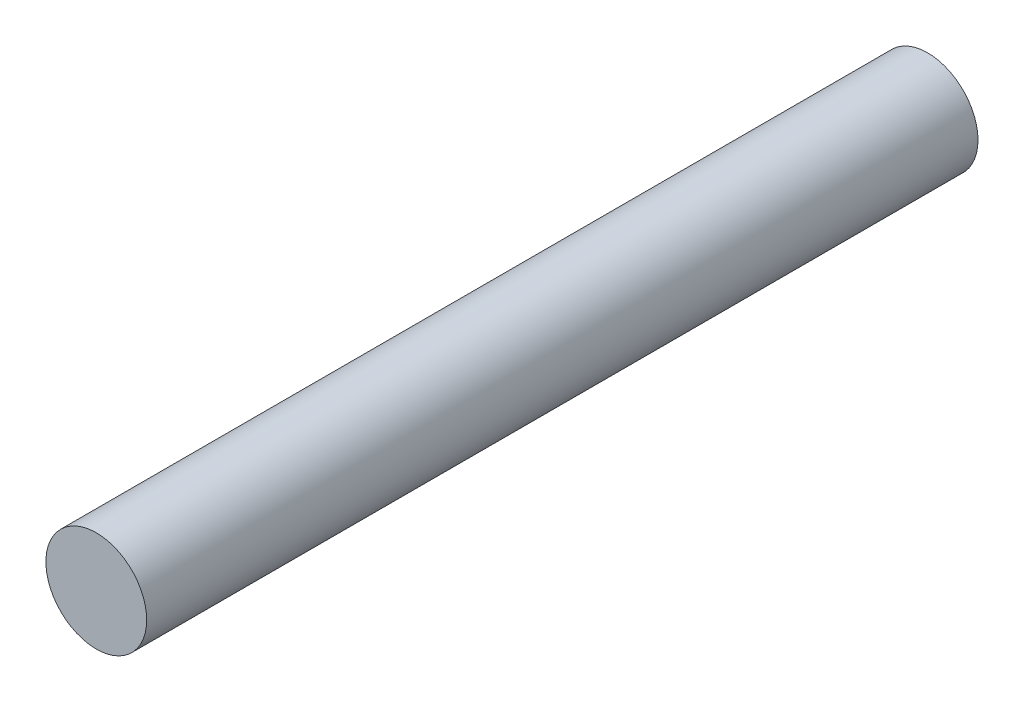
ISO-10303-21;
HEADER;
FILE_DESCRIPTION(('STEP AP214'),'2;1');
FILE_NAME('part.step','',(''),(''),'','','');
FILE_SCHEMA(('AUTOMOTIVE_DESIGN { 1 0 10303 214 1 1 1 1 }'));
ENDSEC;
DATA;
#1=APPLICATION_CONTEXT('core data for automotive mechanical design processes');
#2=APPLICATION_PROTOCOL_DEFINITION('international standard','automotive_design',2000,#1);
#3=PRODUCT_CONTEXT('',#1,'mechanical');
#4=PRODUCT('Part','Part','',(#3));
#5=PRODUCT_RELATED_PRODUCT_CATEGORY('part','',(#4));
#6=PRODUCT_DEFINITION_FORMATION('','',#4);
#7=PRODUCT_DEFINITION_CONTEXT('part definition',#1,'design');
#8=PRODUCT_DEFINITION('design','',#6,#7);
#9=PRODUCT_DEFINITION_SHAPE('','',#8);
#10=(LENGTH_UNIT() NAMED_UNIT(*) SI_UNIT(.MILLI.,.METRE.));
#11=(NAMED_UNIT(*) PLANE_ANGLE_UNIT() SI_UNIT($,.RADIAN.));
#12=(NAMED_UNIT(*) SI_UNIT($,.STERADIAN.) SOLID_ANGLE_UNIT());
#13=UNCERTAINTY_MEASURE_WITH_UNIT(LENGTH_MEASURE(1.E-05),#10,'distance_accuracy_value','');
#14=(GEOMETRIC_REPRESENTATION_CONTEXT(3) GLOBAL_UNCERTAINTY_ASSIGNED_CONTEXT((#13)) GLOBAL_UNIT_ASSIGNED_CONTEXT((#10,
#11,#12)) REPRESENTATION_CONTEXT('',''));
#15=CARTESIAN_POINT('',(0.,0.,0.));
#16=DIRECTION('',(0.,0.,1.));
#17=DIRECTION('',(1.,0.,0.));
#18=AXIS2_PLACEMENT_3D('',#15,#16,#17);
#19=CARTESIAN_POINT('',(0.,0.,1980.));
#20=DIRECTION('',(0.,0.,-1.));
#21=DIRECTION('',(-1.,0.,0.));
#22=AXIS2_PLACEMENT_3D('',#19,#20,#21);
#23=CYLINDRICAL_SURFACE('',#22,120.);
#24=CARTESIAN_POINT('',(0.,0.,1980.));
#25=DIRECTION('',(0.,0.,1.));
#26=DIRECTION('',(1.,0.,0.));
#27=AXIS2_PLACEMENT_3D('',#24,#25,#26);
#28=CIRCLE('',#27,120.);
#29=CARTESIAN_POINT('',(120.,0.,1980.));
#30=VERTEX_POINT('',#29);
#31=EDGE_CURVE('E10',#30,#30,#28,.T.);
#32=ORIENTED_EDGE('',*,*,#31,.F.);
#33=EDGE_LOOP('',(#32));
#34=FACE_BOUND('',#33,.T.);
#35=CARTESIAN_POINT('',(0.,0.,0.));
#36=DIRECTION('',(0.,0.,1.));
#37=DIRECTION('',(1.,0.,0.));
#38=AXIS2_PLACEMENT_3D('',#35,#36,#37);
#39=CIRCLE('',#38,120.);
#40=CARTESIAN_POINT('',(120.,0.,0.));
#41=VERTEX_POINT('',#40);
#42=EDGE_CURVE('E34',#41,#41,#39,.T.);
#43=ORIENTED_EDGE('',*,*,#42,.T.);
#44=EDGE_LOOP('',(#43));
#45=FACE_BOUND('',#44,.T.);
#46=ADVANCED_FACE('F31',(#34,#45),#23,.T.);
#47=CARTESIAN_POINT('',(0.,0.,1980.));
#48=DIRECTION('',(0.,0.,1.));
#49=DIRECTION('',(1.,0.,0.));
#50=AXIS2_PLACEMENT_3D('',#47,#48,#49);
#51=PLANE('',#50);
#52=ORIENTED_EDGE('',*,*,#31,.T.);
#53=EDGE_LOOP('',(#52));
#54=FACE_BOUND('',#53,.T.);
#55=ADVANCED_FACE('F46',(#54),#51,.T.);
#56=CARTESIAN_POINT('',(0.,0.,0.));
#57=DIRECTION('',(0.,0.,1.));
#58=DIRECTION('',(1.,0.,0.));
#59=AXIS2_PLACEMENT_3D('',#56,#57,#58);
#60=PLANE('',#59);
#61=ORIENTED_EDGE('',*,*,#42,.F.);
#62=EDGE_LOOP('',(#61));
#63=FACE_BOUND('',#62,.T.);
#64=ADVANCED_FACE('F44',(#63),#60,.F.);
#65=CLOSED_SHELL('',(#46,#55,#64));
#66=MANIFOLD_SOLID_BREP('B2',#65);
#67=ADVANCED_BREP_SHAPE_REPRESENTATION('',(#18,#66),#14);
#68=SHAPE_DEFINITION_REPRESENTATION(#9,#67);
ENDSEC;
END-ISO-10303-21;
